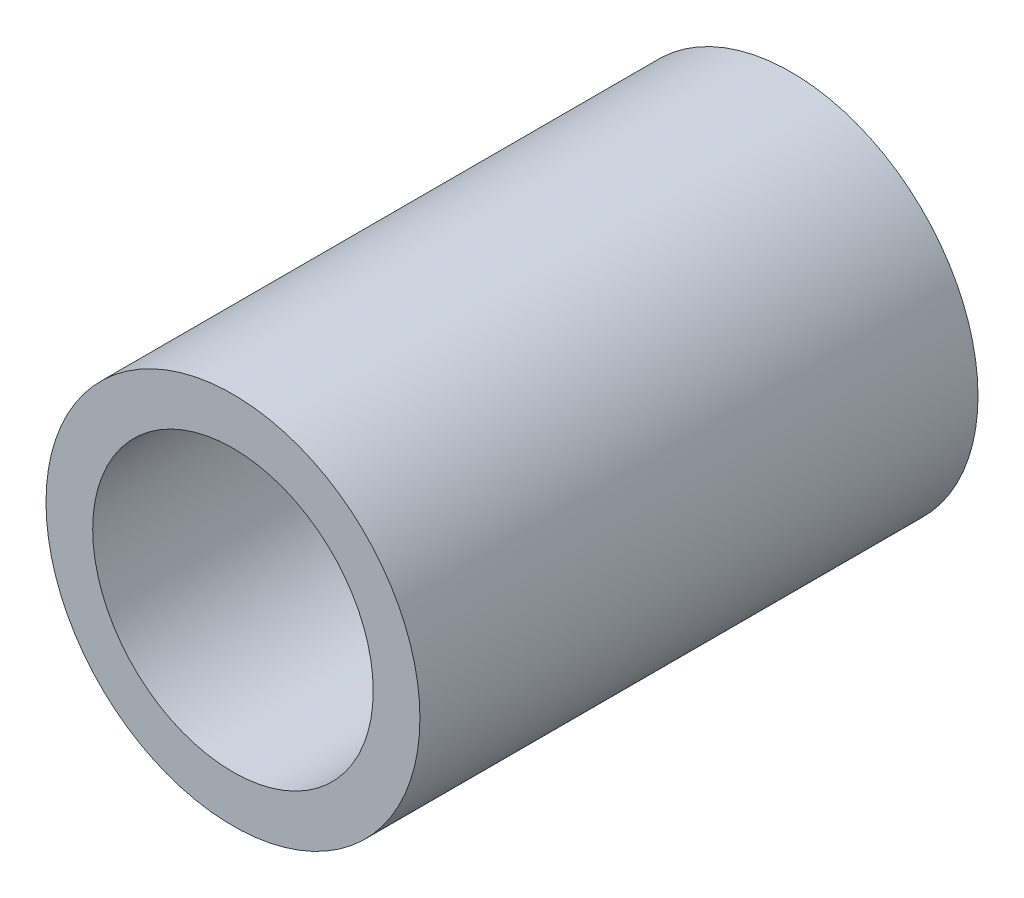
ISO-10303-21;
HEADER;
FILE_DESCRIPTION(('STEP AP214'),'2;1');
FILE_NAME('part.step','',(''),(''),'','','');
FILE_SCHEMA(('AUTOMOTIVE_DESIGN { 1 0 10303 214 1 1 1 1 }'));
ENDSEC;
DATA;
#1=APPLICATION_CONTEXT('core data for automotive mechanical design processes');
#2=APPLICATION_PROTOCOL_DEFINITION('international standard','automotive_design',2000,#1);
#3=PRODUCT_CONTEXT('',#1,'mechanical');
#4=PRODUCT('Part','Part','',(#3));
#5=PRODUCT_RELATED_PRODUCT_CATEGORY('part','',(#4));
#6=PRODUCT_DEFINITION_FORMATION('','',#4);
#7=PRODUCT_DEFINITION_CONTEXT('part definition',#1,'design');
#8=PRODUCT_DEFINITION('design','',#6,#7);
#9=PRODUCT_DEFINITION_SHAPE('','',#8);
#10=(LENGTH_UNIT() NAMED_UNIT(*) SI_UNIT(.MILLI.,.METRE.));
#11=(NAMED_UNIT(*) PLANE_ANGLE_UNIT() SI_UNIT($,.RADIAN.));
#12=(NAMED_UNIT(*) SI_UNIT($,.STERADIAN.) SOLID_ANGLE_UNIT());
#13=UNCERTAINTY_MEASURE_WITH_UNIT(LENGTH_MEASURE(1.E-05),#10,'distance_accuracy_value','');
#14=(GEOMETRIC_REPRESENTATION_CONTEXT(3) GLOBAL_UNCERTAINTY_ASSIGNED_CONTEXT((#13)) GLOBAL_UNIT_ASSIGNED_CONTEXT((#10,
#11,#12)) REPRESENTATION_CONTEXT('',''));
#15=CARTESIAN_POINT('',(0.,0.,0.));
#16=DIRECTION('',(0.,0.,1.));
#17=DIRECTION('',(1.,0.,0.));
#18=AXIS2_PLACEMENT_3D('',#15,#16,#17);
#19=CARTESIAN_POINT('',(0.,0.,-9.525));
#20=DIRECTION('',(0.,0.,1.));
#21=DIRECTION('',(1.,0.,0.));
#22=AXIS2_PLACEMENT_3D('',#19,#20,#21);
#23=CYLINDRICAL_SURFACE('',#22,4.7879);
#24=CARTESIAN_POINT('',(0.,0.,9.525));
#25=DIRECTION('',(0.,0.,1.));
#26=DIRECTION('',(1.,0.,0.));
#27=AXIS2_PLACEMENT_3D('',#24,#25,#26);
#28=CIRCLE('',#27,4.7879);
#29=CARTESIAN_POINT('',(4.7879,0.,9.525));
#30=VERTEX_POINT('',#29);
#31=EDGE_CURVE('E17',#30,#30,#28,.F.);
#32=ORIENTED_EDGE('',*,*,#31,.F.);
#33=EDGE_LOOP('',(#32));
#34=FACE_BOUND('',#33,.T.);
#35=CARTESIAN_POINT('',(0.,0.,-9.525));
#36=DIRECTION('',(0.,0.,1.));
#37=DIRECTION('',(1.,0.,0.));
#38=AXIS2_PLACEMENT_3D('',#35,#36,#37);
#39=CIRCLE('',#38,4.7879);
#40=CARTESIAN_POINT('',(4.7879,0.,-9.525));
#41=VERTEX_POINT('',#40);
#42=EDGE_CURVE('E26',#41,#41,#39,.T.);
#43=ORIENTED_EDGE('',*,*,#42,.F.);
#44=EDGE_LOOP('',(#43));
#45=FACE_BOUND('',#44,.T.);
#46=ADVANCED_FACE('F14',(#34,#45),#23,.F.);
#47=CARTESIAN_POINT('',(0.,6.38175,9.525));
#48=DIRECTION('',(0.,0.,1.));
#49=DIRECTION('',(1.,0.,0.));
#50=AXIS2_PLACEMENT_3D('',#47,#48,#49);
#51=PLANE('',#50);
#52=CARTESIAN_POINT('',(0.,0.,9.525));
#53=DIRECTION('',(0.,0.,1.));
#54=DIRECTION('',(1.,0.,0.));
#55=AXIS2_PLACEMENT_3D('',#52,#53,#54);
#56=CIRCLE('',#55,6.38175);
#57=CARTESIAN_POINT('',(6.38175,0.,9.525));
#58=VERTEX_POINT('',#57);
#59=EDGE_CURVE('E21',#58,#58,#56,.F.);
#60=ORIENTED_EDGE('',*,*,#59,.F.);
#61=EDGE_LOOP('',(#60));
#62=FACE_BOUND('',#61,.T.);
#63=ORIENTED_EDGE('',*,*,#31,.T.);
#64=EDGE_LOOP('',(#63));
#65=FACE_BOUND('',#64,.T.);
#66=ADVANCED_FACE('F34',(#62,#65),#51,.T.);
#67=CARTESIAN_POINT('',(0.,4.7879,-9.525));
#68=DIRECTION('',(0.,0.,-1.));
#69=DIRECTION('',(-1.,0.,0.));
#70=AXIS2_PLACEMENT_3D('',#67,#68,#69);
#71=PLANE('',#70);
#72=ORIENTED_EDGE('',*,*,#42,.T.);
#73=EDGE_LOOP('',(#72));
#74=FACE_BOUND('',#73,.T.);
#75=CARTESIAN_POINT('',(0.,0.,-9.525));
#76=DIRECTION('',(0.,0.,1.));
#77=DIRECTION('',(1.,0.,0.));
#78=AXIS2_PLACEMENT_3D('',#75,#76,#77);
#79=CIRCLE('',#78,6.38175);
#80=CARTESIAN_POINT('',(6.38175,0.,-9.525));
#81=VERTEX_POINT('',#80);
#82=EDGE_CURVE('E10',#81,#81,#79,.T.);
#83=ORIENTED_EDGE('',*,*,#82,.F.);
#84=EDGE_LOOP('',(#83));
#85=FACE_BOUND('',#84,.T.);
#86=ADVANCED_FACE('F42',(#74,#85),#71,.T.);
#87=CARTESIAN_POINT('',(0.,0.,-9.525));
#88=DIRECTION('',(0.,0.,1.));
#89=DIRECTION('',(1.,0.,0.));
#90=AXIS2_PLACEMENT_3D('',#87,#88,#89);
#91=CYLINDRICAL_SURFACE('',#90,6.38175);
#92=ORIENTED_EDGE('',*,*,#82,.T.);
#93=EDGE_LOOP('',(#92));
#94=FACE_BOUND('',#93,.T.);
#95=ORIENTED_EDGE('',*,*,#59,.T.);
#96=EDGE_LOOP('',(#95));
#97=FACE_BOUND('',#96,.T.);
#98=ADVANCED_FACE('F44',(#94,#97),#91,.T.);
#99=CLOSED_SHELL('',(#46,#66,#86,#98));
#100=MANIFOLD_SOLID_BREP('B1',#99);
#101=ADVANCED_BREP_SHAPE_REPRESENTATION('',(#18,#100),#14);
#102=SHAPE_DEFINITION_REPRESENTATION(#9,#101);
ENDSEC;
END-ISO-10303-21;
